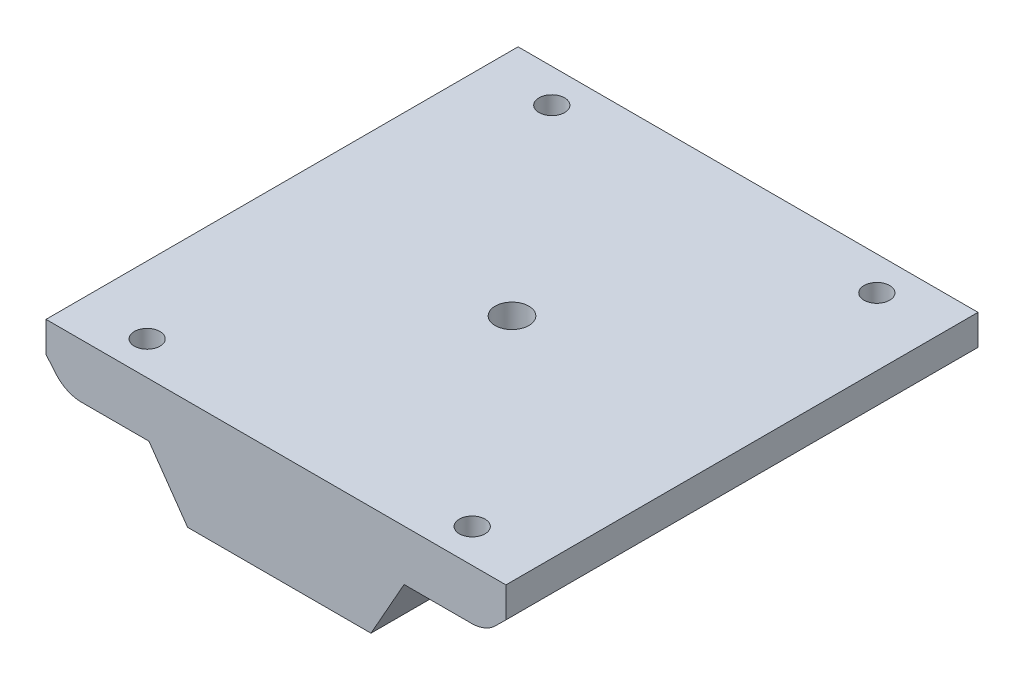
ISO-10303-21;
HEADER;
FILE_DESCRIPTION(('STEP AP214'),'2;1');
FILE_NAME('part.step','',(''),(''),'','','');
FILE_SCHEMA(('AUTOMOTIVE_DESIGN { 1 0 10303 214 1 1 1 1 }'));
ENDSEC;
DATA;
#1=APPLICATION_CONTEXT('core data for automotive mechanical design processes');
#2=APPLICATION_PROTOCOL_DEFINITION('international standard','automotive_design',2000,#1);
#3=PRODUCT_CONTEXT('',#1,'mechanical');
#4=PRODUCT('Part','Part','',(#3));
#5=PRODUCT_RELATED_PRODUCT_CATEGORY('part','',(#4));
#6=PRODUCT_DEFINITION_FORMATION('','',#4);
#7=PRODUCT_DEFINITION_CONTEXT('part definition',#1,'design');
#8=PRODUCT_DEFINITION('design','',#6,#7);
#9=PRODUCT_DEFINITION_SHAPE('','',#8);
#10=(LENGTH_UNIT() NAMED_UNIT(*) SI_UNIT(.MILLI.,.METRE.));
#11=(NAMED_UNIT(*) PLANE_ANGLE_UNIT() SI_UNIT($,.RADIAN.));
#12=(NAMED_UNIT(*) SI_UNIT($,.STERADIAN.) SOLID_ANGLE_UNIT());
#13=UNCERTAINTY_MEASURE_WITH_UNIT(LENGTH_MEASURE(1.E-05),#10,'distance_accuracy_value','');
#14=(GEOMETRIC_REPRESENTATION_CONTEXT(3) GLOBAL_UNCERTAINTY_ASSIGNED_CONTEXT((#13)) GLOBAL_UNIT_ASSIGNED_CONTEXT((#10,
#11,#12)) REPRESENTATION_CONTEXT('',''));
#15=CARTESIAN_POINT('',(0.,0.,0.));
#16=DIRECTION('',(0.,0.,1.));
#17=DIRECTION('',(1.,0.,0.));
#18=AXIS2_PLACEMENT_3D('',#15,#16,#17);
#19=CARTESIAN_POINT('',(61.2178905358612,-38.328223009082,70.01));
#20=DIRECTION('',(0.,-1.,0.));
#21=DIRECTION('',(0.,0.,-1.));
#22=AXIS2_PLACEMENT_3D('',#19,#20,#21);
#23=PLANE('',#22);
#24=CARTESIAN_POINT('',(3.01931217837568,-38.328223009082,5.));
#25=DIRECTION('',(0.,-1.,0.));
#26=DIRECTION('',(0.,0.,-1.));
#27=AXIS2_PLACEMENT_3D('',#24,#25,#26);
#28=CIRCLE('',#27,1.9);
#29=CARTESIAN_POINT('',(3.01931217837568,-38.328223009082,3.1));
#30=VERTEX_POINT('',#29);
#31=EDGE_CURVE('E288',#30,#30,#28,.T.);
#32=ORIENTED_EDGE('',*,*,#31,.T.);
#33=EDGE_LOOP('',(#32));
#34=FACE_BOUND('',#33,.T.);
#35=CARTESIAN_POINT('',(51.2178905358612,-38.328223009082,5.));
#36=DIRECTION('',(0.,-1.,0.));
#37=DIRECTION('',(0.,0.,-1.));
#38=AXIS2_PLACEMENT_3D('',#35,#36,#37);
#39=CIRCLE('',#38,1.9);
#40=CARTESIAN_POINT('',(51.2178905358612,-38.328223009082,3.1));
#41=VERTEX_POINT('',#40);
#42=EDGE_CURVE('E292',#41,#41,#39,.T.);
#43=ORIENTED_EDGE('',*,*,#42,.T.);
#44=EDGE_LOOP('',(#43));
#45=FACE_BOUND('',#44,.T.);
#46=CARTESIAN_POINT('',(51.2178905358612,-38.328223009082,65.));
#47=DIRECTION('',(0.,-1.,0.));
#48=DIRECTION('',(0.,0.,-1.));
#49=AXIS2_PLACEMENT_3D('',#46,#47,#48);
#50=CIRCLE('',#49,1.9);
#51=CARTESIAN_POINT('',(51.2178905358612,-38.328223009082,63.1));
#52=VERTEX_POINT('',#51);
#53=EDGE_CURVE('E282',#52,#52,#50,.T.);
#54=ORIENTED_EDGE('',*,*,#53,.T.);
#55=EDGE_LOOP('',(#54));
#56=FACE_BOUND('',#55,.T.);
#57=CARTESIAN_POINT('',(3.01931217837568,-38.328223009082,65.));
#58=DIRECTION('',(0.,-1.,0.));
#59=DIRECTION('',(0.,0.,-1.));
#60=AXIS2_PLACEMENT_3D('',#57,#58,#59);
#61=CIRCLE('',#60,1.9);
#62=CARTESIAN_POINT('',(3.01931217837568,-38.328223009082,63.1));
#63=VERTEX_POINT('',#62);
#64=EDGE_CURVE('E269',#63,#63,#61,.T.);
#65=ORIENTED_EDGE('',*,*,#64,.T.);
#66=EDGE_LOOP('',(#65));
#67=FACE_BOUND('',#66,.T.);
#68=DIRECTION('',(1.,0.,0.));
#69=VECTOR('',#68,1.);
#70=CARTESIAN_POINT('',(0.,-38.328223009082,70.));
#71=LINE('',#70,#69);
#72=CARTESIAN_POINT('',(-6.98068782162433,-38.328223009082,70.));
#73=VERTEX_POINT('',#72);
#74=CARTESIAN_POINT('',(61.2178905358612,-38.328223009082,70.));
#75=VERTEX_POINT('',#74);
#76=EDGE_CURVE('E11',#73,#75,#71,.T.);
#77=ORIENTED_EDGE('',*,*,#76,.T.);
#78=DIRECTION('',(0.,0.,1.));
#79=VECTOR('',#78,1.);
#80=CARTESIAN_POINT('',(61.2178905358612,-38.328223009082,70.));
#81=LINE('',#80,#79);
#82=CARTESIAN_POINT('',(61.2178905358612,-38.328223009082,0.));
#83=VERTEX_POINT('',#82);
#84=EDGE_CURVE('E51',#83,#75,#81,.T.);
#85=ORIENTED_EDGE('',*,*,#84,.F.);
#86=DIRECTION('',(1.,0.,0.));
#87=VECTOR('',#86,1.);
#88=CARTESIAN_POINT('',(0.,-38.328223009082,0.));
#89=LINE('',#88,#87);
#90=CARTESIAN_POINT('',(-6.98068782162433,-38.328223009082,0.));
#91=VERTEX_POINT('',#90);
#92=EDGE_CURVE('E260',#91,#83,#89,.T.);
#93=ORIENTED_EDGE('',*,*,#92,.F.);
#94=DIRECTION('',(0.,0.,-1.));
#95=VECTOR('',#94,1.);
#96=CARTESIAN_POINT('',(-6.98068782162433,-38.328223009082,70.));
#97=LINE('',#96,#95);
#98=EDGE_CURVE('E64',#73,#91,#97,.T.);
#99=ORIENTED_EDGE('',*,*,#98,.F.);
#100=EDGE_LOOP('',(#77,#85,#93,#99));
#101=FACE_BOUND('',#100,.T.);
#102=CARTESIAN_POINT('',(27.1186013571184,-38.328223009082,35.));
#103=DIRECTION('',(0.,-1.,0.));
#104=DIRECTION('',(0.,0.,-1.));
#105=AXIS2_PLACEMENT_3D('',#102,#103,#104);
#106=CIRCLE('',#105,2.5);
#107=CARTESIAN_POINT('',(27.1186013571184,-38.328223009082,32.5));
#108=VERTEX_POINT('',#107);
#109=EDGE_CURVE('E143',#108,#108,#106,.F.);
#110=ORIENTED_EDGE('',*,*,#109,.F.);
#111=EDGE_LOOP('',(#110));
#112=FACE_BOUND('',#111,.T.);
#113=ADVANCED_FACE('F42',(#34,#45,#56,#67,#101,#112),#23,.F.);
#114=CARTESIAN_POINT('',(27.1186013571184,-46.3409621638789,35.));
#115=DIRECTION('',(0.,1.,0.));
#116=DIRECTION('',(0.,0.,1.));
#117=AXIS2_PLACEMENT_3D('',#114,#115,#116);
#118=PLANE('',#117);
#119=CARTESIAN_POINT('',(27.1186013571184,-46.3409621638789,35.));
#120=DIRECTION('',(0.,1.,0.));
#121=DIRECTION('',(0.,0.,1.));
#122=AXIS2_PLACEMENT_3D('',#119,#120,#121);
#123=CIRCLE('',#122,2.5);
#124=CARTESIAN_POINT('',(27.1186013571184,-46.3409621638789,37.5));
#125=VERTEX_POINT('',#124);
#126=EDGE_CURVE('E167',#125,#125,#123,.T.);
#127=ORIENTED_EDGE('',*,*,#126,.T.);
#128=EDGE_LOOP('',(#127));
#129=FACE_BOUND('',#128,.T.);
#130=ADVANCED_FACE('F307',(#129),#118,.T.);
#131=CARTESIAN_POINT('',(27.1186013571184,-46.3409621638789,35.));
#132=DIRECTION('',(0.,1.,0.));
#133=DIRECTION('',(-1.,0.,0.));
#134=AXIS2_PLACEMENT_3D('',#131,#132,#133);
#135=CYLINDRICAL_SURFACE('',#134,2.5);
#136=ORIENTED_EDGE('',*,*,#109,.T.);
#137=EDGE_LOOP('',(#136));
#138=FACE_BOUND('',#137,.T.);
#139=ORIENTED_EDGE('',*,*,#126,.F.);
#140=EDGE_LOOP('',(#139));
#141=FACE_BOUND('',#140,.T.);
#142=ADVANCED_FACE('F318',(#138,#141),#135,.F.);
#143=CARTESIAN_POINT('',(-1.71108480498256,-41.3409621638789,70.));
#144=DIRECTION('',(0.,0.,-1.));
#145=DIRECTION('',(-1.,0.,0.));
#146=AXIS2_PLACEMENT_3D('',#143,#144,#145);
#147=CYLINDRICAL_SURFACE('',#146,5.00000000000001);
#148=CARTESIAN_POINT('',(-1.71108480498256,-41.3409621638789,0.));
#149=DIRECTION('',(0.,0.,1.));
#150=DIRECTION('',(1.,0.,0.));
#151=AXIS2_PLACEMENT_3D('',#148,#149,#150);
#152=CIRCLE('',#151,5.00000000000001);
#153=CARTESIAN_POINT('',(-1.71108480498256,-46.3409621638789,0.));
#154=VERTEX_POINT('',#153);
#155=CARTESIAN_POINT('',(-5.55170003050841,-44.5424734772213,0.));
#156=VERTEX_POINT('',#155);
#157=EDGE_CURVE('E139',#154,#156,#152,.F.);
#158=ORIENTED_EDGE('',*,*,#157,.F.);
#159=DIRECTION('',(0.,0.,-1.));
#160=VECTOR('',#159,1.);
#161=CARTESIAN_POINT('',(-1.71108480498256,-46.3409621638789,70.));
#162=LINE('',#161,#160);
#163=CARTESIAN_POINT('',(-1.71108480498256,-46.3409621638789,70.));
#164=VERTEX_POINT('',#163);
#165=EDGE_CURVE('E133',#164,#154,#162,.T.);
#166=ORIENTED_EDGE('',*,*,#165,.F.);
#167=CARTESIAN_POINT('',(-1.71108480498256,-41.3409621638789,70.));
#168=DIRECTION('',(0.,0.,1.));
#169=DIRECTION('',(1.,0.,0.));
#170=AXIS2_PLACEMENT_3D('',#167,#168,#169);
#171=CIRCLE('',#170,5.00000000000001);
#172=CARTESIAN_POINT('',(-5.55170003050841,-44.5424734772213,70.));
#173=VERTEX_POINT('',#172);
#174=EDGE_CURVE('E137',#164,#173,#171,.F.);
#175=ORIENTED_EDGE('',*,*,#174,.T.);
#176=DIRECTION('',(0.,0.,-1.));
#177=VECTOR('',#176,1.);
#178=CARTESIAN_POINT('',(-5.55170003050841,-44.5424734772213,70.));
#179=LINE('',#178,#177);
#180=EDGE_CURVE('E196',#173,#156,#179,.T.);
#181=ORIENTED_EDGE('',*,*,#180,.T.);
#182=EDGE_LOOP('',(#158,#166,#175,#181));
#183=FACE_BOUND('',#182,.T.);
#184=ADVANCED_FACE('F135',(#183),#147,.T.);
#185=CARTESIAN_POINT('',(0.,-46.3409621638789,70.));
#186=DIRECTION('',(0.,1.,0.));
#187=DIRECTION('',(0.,0.,1.));
#188=AXIS2_PLACEMENT_3D('',#185,#186,#187);
#189=PLANE('',#188);
#190=CARTESIAN_POINT('',(3.01931217837568,-46.3409621638789,5.));
#191=DIRECTION('',(0.,-1.,0.));
#192=DIRECTION('',(0.,0.,-1.));
#193=AXIS2_PLACEMENT_3D('',#190,#191,#192);
#194=CIRCLE('',#193,1.9);
#195=CARTESIAN_POINT('',(3.01931217837568,-46.3409621638789,3.1));
#196=VERTEX_POINT('',#195);
#197=EDGE_CURVE('E284',#196,#196,#194,.T.);
#198=ORIENTED_EDGE('',*,*,#197,.F.);
#199=EDGE_LOOP('',(#198));
#200=FACE_BOUND('',#199,.T.);
#201=CARTESIAN_POINT('',(3.01931217837568,-46.3409621638789,65.));
#202=DIRECTION('',(0.,-1.,0.));
#203=DIRECTION('',(0.,0.,-1.));
#204=AXIS2_PLACEMENT_3D('',#201,#202,#203);
#205=CIRCLE('',#204,1.9);
#206=CARTESIAN_POINT('',(3.01931217837568,-46.3409621638789,63.1));
#207=VERTEX_POINT('',#206);
#208=EDGE_CURVE('E276',#207,#207,#205,.T.);
#209=ORIENTED_EDGE('',*,*,#208,.F.);
#210=EDGE_LOOP('',(#209));
#211=FACE_BOUND('',#210,.T.);
#212=DIRECTION('',(1.,0.,0.));
#213=VECTOR('',#212,1.);
#214=CARTESIAN_POINT('',(0.,-46.3409621638789,0.));
#215=LINE('',#214,#213);
#216=CARTESIAN_POINT('',(8.28891519501744,-46.3409621638789,0.));
#217=VERTEX_POINT('',#216);
#218=EDGE_CURVE('E199',#154,#217,#215,.T.);
#219=ORIENTED_EDGE('',*,*,#218,.T.);
#220=DIRECTION('',(0.,0.,-1.));
#221=VECTOR('',#220,1.);
#222=CARTESIAN_POINT('',(8.28891519501744,-46.3409621638789,70.));
#223=LINE('',#222,#221);
#224=CARTESIAN_POINT('',(8.28891519501744,-46.3409621638789,70.));
#225=VERTEX_POINT('',#224);
#226=EDGE_CURVE('E144',#225,#217,#223,.T.);
#227=ORIENTED_EDGE('',*,*,#226,.F.);
#228=DIRECTION('',(1.,0.,0.));
#229=VECTOR('',#228,1.);
#230=CARTESIAN_POINT('',(0.,-46.3409621638789,70.));
#231=LINE('',#230,#229);
#232=EDGE_CURVE('E147',#164,#225,#231,.T.);
#233=ORIENTED_EDGE('',*,*,#232,.F.);
#234=ORIENTED_EDGE('',*,*,#165,.T.);
#235=EDGE_LOOP('',(#219,#227,#233,#234));
#236=FACE_BOUND('',#235,.T.);
#237=ADVANCED_FACE('F148',(#200,#211,#236),#189,.F.);
#238=CARTESIAN_POINT('',(-16.1866159392816,-11.3089815482512,70.));
#239=DIRECTION('',(0.819746682797115,0.572726266241672,0.));
#240=DIRECTION('',(-0.572726266241672,0.819746682797115,0.));
#241=AXIS2_PLACEMENT_3D('',#238,#239,#240);
#242=PLANE('',#241);
#243=DIRECTION('',(0.572726266241672,-0.819746682797115,0.));
#244=VECTOR('',#243,1.);
#245=CARTESIAN_POINT('',(-16.1866159392816,-11.3089815482512,0.));
#246=LINE('',#245,#244);
#247=CARTESIAN_POINT('',(14.0161778574342,-54.5384289918501,0.));
#248=VERTEX_POINT('',#247);
#249=EDGE_CURVE('E202',#217,#248,#246,.T.);
#250=ORIENTED_EDGE('',*,*,#249,.T.);
#251=DIRECTION('',(0.,0.,-1.));
#252=VECTOR('',#251,1.);
#253=CARTESIAN_POINT('',(14.0161778574342,-54.5384289918501,70.));
#254=LINE('',#253,#252);
#255=CARTESIAN_POINT('',(14.0161778574342,-54.5384289918501,70.));
#256=VERTEX_POINT('',#255);
#257=EDGE_CURVE('E251',#256,#248,#254,.T.);
#258=ORIENTED_EDGE('',*,*,#257,.F.);
#259=DIRECTION('',(0.572726266241672,-0.819746682797115,0.));
#260=VECTOR('',#259,1.);
#261=CARTESIAN_POINT('',(-16.1866159392816,-11.3089815482512,70.));
#262=LINE('',#261,#260);
#263=EDGE_CURVE('E153',#225,#256,#262,.T.);
#264=ORIENTED_EDGE('',*,*,#263,.F.);
#265=ORIENTED_EDGE('',*,*,#226,.T.);
#266=EDGE_LOOP('',(#250,#258,#264,#265));
#267=FACE_BOUND('',#266,.T.);
#268=ADVANCED_FACE('F365',(#267),#242,.F.);
#269=CARTESIAN_POINT('',(0.,-54.5384289918501,70.));
#270=DIRECTION('',(0.,1.,0.));
#271=DIRECTION('',(0.,0.,1.));
#272=AXIS2_PLACEMENT_3D('',#269,#270,#271);
#273=PLANE('',#272);
#274=DIRECTION('',(1.,0.,0.));
#275=VECTOR('',#274,1.);
#276=CARTESIAN_POINT('',(0.,-54.5384289918501,0.));
#277=LINE('',#276,#275);
#278=CARTESIAN_POINT('',(41.2083028070856,-54.5384289918501,0.));
#279=VERTEX_POINT('',#278);
#280=EDGE_CURVE('E205',#248,#279,#277,.T.);
#281=ORIENTED_EDGE('',*,*,#280,.T.);
#282=DIRECTION('',(0.,0.,-1.));
#283=VECTOR('',#282,1.);
#284=CARTESIAN_POINT('',(41.2083028070856,-54.5384289918501,70.));
#285=LINE('',#284,#283);
#286=CARTESIAN_POINT('',(41.2083028070856,-54.5384289918501,70.));
#287=VERTEX_POINT('',#286);
#288=EDGE_CURVE('E247',#287,#279,#285,.T.);
#289=ORIENTED_EDGE('',*,*,#288,.F.);
#290=DIRECTION('',(1.,0.,0.));
#291=VECTOR('',#290,1.);
#292=CARTESIAN_POINT('',(0.,-54.5384289918501,70.));
#293=LINE('',#292,#291);
#294=EDGE_CURVE('E172',#256,#287,#293,.T.);
#295=ORIENTED_EDGE('',*,*,#294,.F.);
#296=ORIENTED_EDGE('',*,*,#257,.T.);
#297=EDGE_LOOP('',(#281,#289,#295,#296));
#298=FACE_BOUND('',#297,.T.);
#299=ADVANCED_FACE('F362',(#298),#273,.F.);
#300=CARTESIAN_POINT('',(54.6000068319005,-30.7938319190066,70.));
#301=DIRECTION('',(-0.871020598276808,0.491246493501492,0.));
#302=DIRECTION('',(-0.491246493501492,-0.871020598276808,0.));
#303=AXIS2_PLACEMENT_3D('',#300,#301,#302);
#304=PLANE('',#303);
#305=DIRECTION('',(0.491246493501492,0.871020598276808,0.));
#306=VECTOR('',#305,1.);
#307=CARTESIAN_POINT('',(54.6000068319005,-30.7938319190066,0.));
#308=LINE('',#307,#306);
#309=CARTESIAN_POINT('',(46.1207677421006,-45.828223009082,0.));
#310=VERTEX_POINT('',#309);
#311=EDGE_CURVE('E208',#279,#310,#308,.T.);
#312=ORIENTED_EDGE('',*,*,#311,.T.);
#313=DIRECTION('',(0.,0.,-1.));
#314=VECTOR('',#313,1.);
#315=CARTESIAN_POINT('',(46.1207677421006,-45.828223009082,70.));
#316=LINE('',#315,#314);
#317=CARTESIAN_POINT('',(46.1207677421006,-45.828223009082,70.));
#318=VERTEX_POINT('',#317);
#319=EDGE_CURVE('E243',#318,#310,#316,.T.);
#320=ORIENTED_EDGE('',*,*,#319,.F.);
#321=DIRECTION('',(0.491246493501492,0.871020598276808,0.));
#322=VECTOR('',#321,1.);
#323=CARTESIAN_POINT('',(54.6000068319005,-30.7938319190066,70.));
#324=LINE('',#323,#322);
#325=EDGE_CURVE('E175',#287,#318,#324,.T.);
#326=ORIENTED_EDGE('',*,*,#325,.F.);
#327=ORIENTED_EDGE('',*,*,#288,.T.);
#328=EDGE_LOOP('',(#312,#320,#326,#327));
#329=FACE_BOUND('',#328,.T.);
#330=ADVANCED_FACE('F334',(#329),#304,.F.);
#331=CARTESIAN_POINT('',(0.,-45.828223009082,70.));
#332=DIRECTION('',(0.,1.,0.));
#333=DIRECTION('',(0.,0.,1.));
#334=AXIS2_PLACEMENT_3D('',#331,#332,#333);
#335=PLANE('',#334);
#336=CARTESIAN_POINT('',(51.2178905358612,-45.828223009082,5.));
#337=DIRECTION('',(0.,1.,0.));
#338=DIRECTION('',(0.,0.,1.));
#339=AXIS2_PLACEMENT_3D('',#336,#337,#338);
#340=CIRCLE('',#339,1.9);
#341=CARTESIAN_POINT('',(51.2178905358612,-45.828223009082,6.9));
#342=VERTEX_POINT('',#341);
#343=EDGE_CURVE('E45',#342,#342,#340,.T.);
#344=ORIENTED_EDGE('',*,*,#343,.T.);
#345=EDGE_LOOP('',(#344));
#346=FACE_BOUND('',#345,.T.);
#347=CARTESIAN_POINT('',(51.2178905358612,-45.828223009082,65.));
#348=DIRECTION('',(0.,1.,0.));
#349=DIRECTION('',(0.,0.,1.));
#350=AXIS2_PLACEMENT_3D('',#347,#348,#349);
#351=CIRCLE('',#350,1.9);
#352=CARTESIAN_POINT('',(51.2178905358612,-45.828223009082,66.9));
#353=VERTEX_POINT('',#352);
#354=EDGE_CURVE('E266',#353,#353,#351,.T.);
#355=ORIENTED_EDGE('',*,*,#354,.T.);
#356=EDGE_LOOP('',(#355));
#357=FACE_BOUND('',#356,.T.);
#358=DIRECTION('',(1.,0.,0.));
#359=VECTOR('',#358,1.);
#360=CARTESIAN_POINT('',(0.,-45.828223009082,0.));
#361=LINE('',#360,#359);
#362=CARTESIAN_POINT('',(56.1207677421005,-45.828223009082,0.));
#363=VERTEX_POINT('',#362);
#364=EDGE_CURVE('E211',#310,#363,#361,.T.);
#365=ORIENTED_EDGE('',*,*,#364,.T.);
#366=DIRECTION('',(0.,0.,-1.));
#367=VECTOR('',#366,1.);
#368=CARTESIAN_POINT('',(56.1207677421005,-45.828223009082,70.));
#369=LINE('',#368,#367);
#370=CARTESIAN_POINT('',(56.1207677421005,-45.828223009082,70.));
#371=VERTEX_POINT('',#370);
#372=EDGE_CURVE('E239',#371,#363,#369,.T.);
#373=ORIENTED_EDGE('',*,*,#372,.F.);
#374=DIRECTION('',(1.,0.,0.));
#375=VECTOR('',#374,1.);
#376=CARTESIAN_POINT('',(0.,-45.828223009082,70.));
#377=LINE('',#376,#375);
#378=EDGE_CURVE('E178',#318,#371,#377,.T.);
#379=ORIENTED_EDGE('',*,*,#378,.F.);
#380=ORIENTED_EDGE('',*,*,#319,.T.);
#381=EDGE_LOOP('',(#365,#373,#379,#380));
#382=FACE_BOUND('',#381,.T.);
#383=ADVANCED_FACE('F331',(#346,#357,#382),#335,.F.);
#384=CARTESIAN_POINT('',(56.1207677421005,-40.828223009082,70.));
#385=DIRECTION('',(0.,0.,-1.));
#386=DIRECTION('',(-1.,0.,0.));
#387=AXIS2_PLACEMENT_3D('',#384,#385,#386);
#388=CYLINDRICAL_SURFACE('',#387,5.00000000000001);
#389=CARTESIAN_POINT('',(56.1207677421005,-40.828223009082,0.));
#390=DIRECTION('',(0.,0.,1.));
#391=DIRECTION('',(1.,0.,0.));
#392=AXIS2_PLACEMENT_3D('',#389,#390,#391);
#393=CIRCLE('',#392,5.00000000000001);
#394=CARTESIAN_POINT('',(59.6267170131198,-44.3930960375418,0.));
#395=VERTEX_POINT('',#394);
#396=EDGE_CURVE('E214',#363,#395,#393,.T.);
#397=ORIENTED_EDGE('',*,*,#396,.T.);
#398=DIRECTION('',(0.,0.,-1.));
#399=VECTOR('',#398,1.);
#400=CARTESIAN_POINT('',(59.6267170131198,-44.3930960375418,70.));
#401=LINE('',#400,#399);
#402=CARTESIAN_POINT('',(59.6267170131198,-44.3930960375418,70.));
#403=VERTEX_POINT('',#402);
#404=EDGE_CURVE('E235',#403,#395,#401,.T.);
#405=ORIENTED_EDGE('',*,*,#404,.F.);
#406=CARTESIAN_POINT('',(56.1207677421005,-40.828223009082,70.));
#407=DIRECTION('',(0.,0.,1.));
#408=DIRECTION('',(1.,0.,0.));
#409=AXIS2_PLACEMENT_3D('',#406,#407,#408);
#410=CIRCLE('',#409,5.00000000000001);
#411=EDGE_CURVE('E181',#371,#403,#410,.T.);
#412=ORIENTED_EDGE('',*,*,#411,.F.);
#413=ORIENTED_EDGE('',*,*,#372,.T.);
#414=EDGE_LOOP('',(#397,#405,#412,#413));
#415=FACE_BOUND('',#414,.T.);
#416=ADVANCED_FACE('F333',(#415),#388,.T.);
#417=CARTESIAN_POINT('',(51.5099670470146,-52.3756843091377,70.));
#418=DIRECTION('',(-0.701189854203842,0.712974605691952,0.));
#419=DIRECTION('',(-0.712974605691952,-0.701189854203842,0.));
#420=AXIS2_PLACEMENT_3D('',#417,#418,#419);
#421=PLANE('',#420);
#422=DIRECTION('',(0.712974605691952,0.701189854203842,0.));
#423=VECTOR('',#422,1.);
#424=CARTESIAN_POINT('',(51.5099670470146,-52.3756843091377,0.));
#425=LINE('',#424,#423);
#426=CARTESIAN_POINT('',(61.2178905358612,-42.828223009082,0.));
#427=VERTEX_POINT('',#426);
#428=EDGE_CURVE('E217',#395,#427,#425,.T.);
#429=ORIENTED_EDGE('',*,*,#428,.T.);
#430=DIRECTION('',(0.,0.,-1.));
#431=VECTOR('',#430,1.);
#432=CARTESIAN_POINT('',(61.2178905358612,-42.828223009082,70.));
#433=LINE('',#432,#431);
#434=CARTESIAN_POINT('',(61.2178905358612,-42.828223009082,70.));
#435=VERTEX_POINT('',#434);
#436=EDGE_CURVE('E231',#435,#427,#433,.T.);
#437=ORIENTED_EDGE('',*,*,#436,.F.);
#438=DIRECTION('',(0.712974605691952,0.701189854203842,0.));
#439=VECTOR('',#438,1.);
#440=CARTESIAN_POINT('',(51.5099670470146,-52.3756843091377,70.));
#441=LINE('',#440,#439);
#442=EDGE_CURVE('E184',#403,#435,#441,.T.);
#443=ORIENTED_EDGE('',*,*,#442,.F.);
#444=ORIENTED_EDGE('',*,*,#404,.T.);
#445=EDGE_LOOP('',(#429,#437,#443,#444));
#446=FACE_BOUND('',#445,.T.);
#447=ADVANCED_FACE('F351',(#446),#421,.F.);
#448=CARTESIAN_POINT('',(61.2178905358612,0.,70.));
#449=DIRECTION('',(-1.,0.,0.));
#450=DIRECTION('',(0.,-1.,0.));
#451=AXIS2_PLACEMENT_3D('',#448,#449,#450);
#452=PLANE('',#451);
#453=DIRECTION('',(0.,1.,0.));
#454=VECTOR('',#453,1.);
#455=CARTESIAN_POINT('',(61.2178905358612,0.,0.));
#456=LINE('',#455,#454);
#457=EDGE_CURVE('E220',#427,#83,#456,.T.);
#458=ORIENTED_EDGE('',*,*,#457,.T.);
#459=ORIENTED_EDGE('',*,*,#84,.T.);
#460=DIRECTION('',(0.,1.,0.));
#461=VECTOR('',#460,1.);
#462=CARTESIAN_POINT('',(61.2178905358612,0.,70.));
#463=LINE('',#462,#461);
#464=EDGE_CURVE('E187',#435,#75,#463,.T.);
#465=ORIENTED_EDGE('',*,*,#464,.F.);
#466=ORIENTED_EDGE('',*,*,#436,.T.);
#467=EDGE_LOOP('',(#458,#459,#465,#466));
#468=FACE_BOUND('',#467,.T.);
#469=ADVANCED_FACE('F353',(#468),#452,.F.);
#470=CARTESIAN_POINT('',(-6.98068782162431,0.,70.));
#471=DIRECTION('',(1.,0.,0.));
#472=DIRECTION('',(0.,1.,0.));
#473=AXIS2_PLACEMENT_3D('',#470,#471,#472);
#474=PLANE('',#473);
#475=DIRECTION('',(0.,-1.,0.));
#476=VECTOR('',#475,1.);
#477=CARTESIAN_POINT('',(-6.98068782162431,0.,70.));
#478=LINE('',#477,#476);
#479=CARTESIAN_POINT('',(-6.98068782162433,-42.828223009082,70.));
#480=VERTEX_POINT('',#479);
#481=EDGE_CURVE('E191',#73,#480,#478,.T.);
#482=ORIENTED_EDGE('',*,*,#481,.F.);
#483=ORIENTED_EDGE('',*,*,#98,.T.);
#484=DIRECTION('',(0.,-1.,0.));
#485=VECTOR('',#484,1.);
#486=CARTESIAN_POINT('',(-6.98068782162431,0.,0.));
#487=LINE('',#486,#485);
#488=CARTESIAN_POINT('',(-6.98068782162433,-42.828223009082,0.));
#489=VERTEX_POINT('',#488);
#490=EDGE_CURVE('E164',#91,#489,#487,.T.);
#491=ORIENTED_EDGE('',*,*,#490,.T.);
#492=DIRECTION('',(0.,0.,-1.));
#493=VECTOR('',#492,1.);
#494=CARTESIAN_POINT('',(-6.98068782162433,-42.828223009082,70.));
#495=LINE('',#494,#493);
#496=EDGE_CURVE('E227',#480,#489,#495,.T.);
#497=ORIENTED_EDGE('',*,*,#496,.F.);
#498=EDGE_LOOP('',(#482,#483,#491,#497));
#499=FACE_BOUND('',#498,.T.);
#500=ADVANCED_FACE('F392',(#499),#474,.F.);
#501=CARTESIAN_POINT('',(-25.1829411371941,-20.9923322748176,70.));
#502=DIRECTION('',(0.768123045105166,0.640302262668473,0.));
#503=DIRECTION('',(-0.640302262668473,0.768123045105166,0.));
#504=AXIS2_PLACEMENT_3D('',#501,#502,#503);
#505=PLANE('',#504);
#506=DIRECTION('',(0.640302262668473,-0.768123045105166,0.));
#507=VECTOR('',#506,1.);
#508=CARTESIAN_POINT('',(-25.1829411371941,-20.9923322748176,0.));
#509=LINE('',#508,#507);
#510=EDGE_CURVE('E160',#489,#156,#509,.T.);
#511=ORIENTED_EDGE('',*,*,#510,.T.);
#512=ORIENTED_EDGE('',*,*,#180,.F.);
#513=DIRECTION('',(0.640302262668473,-0.768123045105166,0.));
#514=VECTOR('',#513,1.);
#515=CARTESIAN_POINT('',(-25.1829411371941,-20.9923322748176,70.));
#516=LINE('',#515,#514);
#517=EDGE_CURVE('E157',#480,#173,#516,.T.);
#518=ORIENTED_EDGE('',*,*,#517,.F.);
#519=ORIENTED_EDGE('',*,*,#496,.T.);
#520=EDGE_LOOP('',(#511,#512,#518,#519));
#521=FACE_BOUND('',#520,.T.);
#522=ADVANCED_FACE('F388',(#521),#505,.F.);
#523=CARTESIAN_POINT('',(0.,0.,70.));
#524=DIRECTION('',(0.,0.,1.));
#525=DIRECTION('',(1.,0.,0.));
#526=AXIS2_PLACEMENT_3D('',#523,#524,#525);
#527=PLANE('',#526);
#528=ORIENTED_EDGE('',*,*,#76,.F.);
#529=ORIENTED_EDGE('',*,*,#481,.T.);
#530=ORIENTED_EDGE('',*,*,#517,.T.);
#531=ORIENTED_EDGE('',*,*,#174,.F.);
#532=ORIENTED_EDGE('',*,*,#232,.T.);
#533=ORIENTED_EDGE('',*,*,#263,.T.);
#534=ORIENTED_EDGE('',*,*,#294,.T.);
#535=ORIENTED_EDGE('',*,*,#325,.T.);
#536=ORIENTED_EDGE('',*,*,#378,.T.);
#537=ORIENTED_EDGE('',*,*,#411,.T.);
#538=ORIENTED_EDGE('',*,*,#442,.T.);
#539=ORIENTED_EDGE('',*,*,#464,.T.);
#540=EDGE_LOOP('',(#528,#529,#530,#531,#532,#533,#534,#535,#536,#537,#538,#539));
#541=FACE_BOUND('',#540,.T.);
#542=ADVANCED_FACE('F155',(#541),#527,.T.);
#543=CARTESIAN_POINT('',(0.,0.,0.));
#544=DIRECTION('',(0.,0.,1.));
#545=DIRECTION('',(1.,0.,0.));
#546=AXIS2_PLACEMENT_3D('',#543,#544,#545);
#547=PLANE('',#546);
#548=ORIENTED_EDGE('',*,*,#490,.F.);
#549=ORIENTED_EDGE('',*,*,#92,.T.);
#550=ORIENTED_EDGE('',*,*,#457,.F.);
#551=ORIENTED_EDGE('',*,*,#428,.F.);
#552=ORIENTED_EDGE('',*,*,#396,.F.);
#553=ORIENTED_EDGE('',*,*,#364,.F.);
#554=ORIENTED_EDGE('',*,*,#311,.F.);
#555=ORIENTED_EDGE('',*,*,#280,.F.);
#556=ORIENTED_EDGE('',*,*,#249,.F.);
#557=ORIENTED_EDGE('',*,*,#218,.F.);
#558=ORIENTED_EDGE('',*,*,#157,.T.);
#559=ORIENTED_EDGE('',*,*,#510,.F.);
#560=EDGE_LOOP('',(#548,#549,#550,#551,#552,#553,#554,#555,#556,#557,#558,#559));
#561=FACE_BOUND('',#560,.T.);
#562=ADVANCED_FACE('F305',(#561),#547,.F.);
#563=CARTESIAN_POINT('',(51.2178905358612,-38.328223009082,65.));
#564=DIRECTION('',(0.,-1.,0.));
#565=DIRECTION('',(0.,0.,-1.));
#566=AXIS2_PLACEMENT_3D('',#563,#564,#565);
#567=CYLINDRICAL_SURFACE('',#566,1.9);
#568=ORIENTED_EDGE('',*,*,#53,.F.);
#569=EDGE_LOOP('',(#568));
#570=FACE_BOUND('',#569,.T.);
#571=ORIENTED_EDGE('',*,*,#354,.F.);
#572=EDGE_LOOP('',(#571));
#573=FACE_BOUND('',#572,.T.);
#574=ADVANCED_FACE('F301',(#570,#573),#567,.F.);
#575=CARTESIAN_POINT('',(51.2178905358612,-38.328223009082,5.));
#576=DIRECTION('',(0.,-1.,0.));
#577=DIRECTION('',(0.,0.,-1.));
#578=AXIS2_PLACEMENT_3D('',#575,#576,#577);
#579=CYLINDRICAL_SURFACE('',#578,1.9);
#580=ORIENTED_EDGE('',*,*,#42,.F.);
#581=EDGE_LOOP('',(#580));
#582=FACE_BOUND('',#581,.T.);
#583=ORIENTED_EDGE('',*,*,#343,.F.);
#584=EDGE_LOOP('',(#583));
#585=FACE_BOUND('',#584,.T.);
#586=ADVANCED_FACE('F304',(#582,#585),#579,.F.);
#587=CARTESIAN_POINT('',(3.01931217837568,-38.328223009082,65.));
#588=DIRECTION('',(0.,-1.,0.));
#589=DIRECTION('',(0.,0.,-1.));
#590=AXIS2_PLACEMENT_3D('',#587,#588,#589);
#591=CYLINDRICAL_SURFACE('',#590,1.9);
#592=ORIENTED_EDGE('',*,*,#64,.F.);
#593=EDGE_LOOP('',(#592));
#594=FACE_BOUND('',#593,.T.);
#595=ORIENTED_EDGE('',*,*,#208,.T.);
#596=EDGE_LOOP('',(#595));
#597=FACE_BOUND('',#596,.T.);
#598=ADVANCED_FACE('F312',(#594,#597),#591,.F.);
#599=CARTESIAN_POINT('',(3.01931217837568,-38.328223009082,5.));
#600=DIRECTION('',(0.,-1.,0.));
#601=DIRECTION('',(0.,0.,-1.));
#602=AXIS2_PLACEMENT_3D('',#599,#600,#601);
#603=CYLINDRICAL_SURFACE('',#602,1.9);
#604=ORIENTED_EDGE('',*,*,#31,.F.);
#605=EDGE_LOOP('',(#604));
#606=FACE_BOUND('',#605,.T.);
#607=ORIENTED_EDGE('',*,*,#197,.T.);
#608=EDGE_LOOP('',(#607));
#609=FACE_BOUND('',#608,.T.);
#610=ADVANCED_FACE('F503',(#606,#609),#603,.F.);
#611=CLOSED_SHELL('',(#113,#130,#142,#184,#237,#268,#299,#330,#383,#416,#447,#469,#500,#522,
#542,#562,#574,#586,#598,#610));
#612=MANIFOLD_SOLID_BREP('B2',#611);
#613=ADVANCED_BREP_SHAPE_REPRESENTATION('',(#18,#612),#14);
#614=SHAPE_DEFINITION_REPRESENTATION(#9,#613);
ENDSEC;
END-ISO-10303-21;
